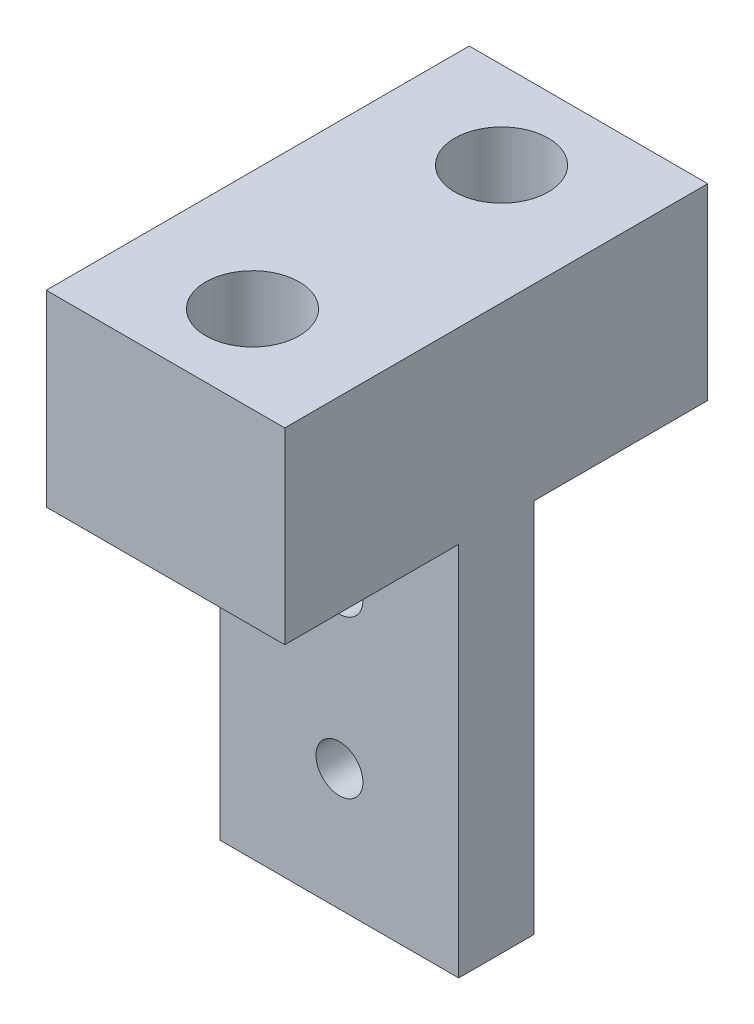
ISO-10303-21;
HEADER;
FILE_DESCRIPTION(('STEP AP214'),'2;1');
FILE_NAME('part.step','',(''),(''),'','','');
FILE_SCHEMA(('AUTOMOTIVE_DESIGN { 1 0 10303 214 1 1 1 1 }'));
ENDSEC;
DATA;
#1=APPLICATION_CONTEXT('core data for automotive mechanical design processes');
#2=APPLICATION_PROTOCOL_DEFINITION('international standard','automotive_design',2000,#1);
#3=PRODUCT_CONTEXT('',#1,'mechanical');
#4=PRODUCT('Part','Part','',(#3));
#5=PRODUCT_RELATED_PRODUCT_CATEGORY('part','',(#4));
#6=PRODUCT_DEFINITION_FORMATION('','',#4);
#7=PRODUCT_DEFINITION_CONTEXT('part definition',#1,'design');
#8=PRODUCT_DEFINITION('design','',#6,#7);
#9=PRODUCT_DEFINITION_SHAPE('','',#8);
#10=(LENGTH_UNIT() NAMED_UNIT(*) SI_UNIT(.MILLI.,.METRE.));
#11=(NAMED_UNIT(*) PLANE_ANGLE_UNIT() SI_UNIT($,.RADIAN.));
#12=(NAMED_UNIT(*) SI_UNIT($,.STERADIAN.) SOLID_ANGLE_UNIT());
#13=UNCERTAINTY_MEASURE_WITH_UNIT(LENGTH_MEASURE(1.E-05),#10,'distance_accuracy_value','');
#14=(GEOMETRIC_REPRESENTATION_CONTEXT(3) GLOBAL_UNCERTAINTY_ASSIGNED_CONTEXT((#13)) GLOBAL_UNIT_ASSIGNED_CONTEXT((#10,
#11,#12)) REPRESENTATION_CONTEXT('',''));
#15=CARTESIAN_POINT('',(0.,0.,0.));
#16=DIRECTION('',(0.,0.,1.));
#17=DIRECTION('',(1.,0.,0.));
#18=AXIS2_PLACEMENT_3D('',#15,#16,#17);
#19=CARTESIAN_POINT('',(12.7,0.,22.5248));
#20=DIRECTION('',(0.,1.,0.));
#21=DIRECTION('',(0.,0.,1.));
#22=AXIS2_PLACEMENT_3D('',#19,#20,#21);
#23=PLANE('',#22);
#24=CARTESIAN_POINT('',(6.35,0.,4.6312));
#25=DIRECTION('',(0.,-1.,0.));
#26=DIRECTION('',(0.,0.,-1.));
#27=AXIS2_PLACEMENT_3D('',#24,#25,#26);
#28=CIRCLE('',#27,2.48920000000001);
#29=CARTESIAN_POINT('',(6.35,0.,2.14199999999999));
#30=VERTEX_POINT('',#29);
#31=EDGE_CURVE('E202',#30,#30,#28,.T.);
#32=ORIENTED_EDGE('',*,*,#31,.T.);
#33=EDGE_LOOP('',(#32));
#34=FACE_BOUND('',#33,.T.);
#35=CARTESIAN_POINT('',(6.35,0.,17.8936));
#36=DIRECTION('',(0.,-1.,0.));
#37=DIRECTION('',(0.,0.,-1.));
#38=AXIS2_PLACEMENT_3D('',#35,#36,#37);
#39=CIRCLE('',#38,2.48920000000001);
#40=CARTESIAN_POINT('',(6.35,0.,15.4044));
#41=VERTEX_POINT('',#40);
#42=EDGE_CURVE('E121',#41,#41,#39,.T.);
#43=ORIENTED_EDGE('',*,*,#42,.T.);
#44=EDGE_LOOP('',(#43));
#45=FACE_BOUND('',#44,.T.);
#46=DIRECTION('',(0.,0.,-1.));
#47=VECTOR('',#46,1.);
#48=CARTESIAN_POINT('',(0.,0.,22.5248));
#49=LINE('',#48,#47);
#50=CARTESIAN_POINT('',(0.,0.,22.5248));
#51=VERTEX_POINT('',#50);
#52=CARTESIAN_POINT('',(0.,0.,0.));
#53=VERTEX_POINT('',#52);
#54=EDGE_CURVE('E141',#51,#53,#49,.T.);
#55=ORIENTED_EDGE('',*,*,#54,.F.);
#56=DIRECTION('',(-1.,0.,0.));
#57=VECTOR('',#56,1.);
#58=CARTESIAN_POINT('',(12.7,0.,22.5248));
#59=LINE('',#58,#57);
#60=CARTESIAN_POINT('',(12.7,0.,22.5248));
#61=VERTEX_POINT('',#60);
#62=EDGE_CURVE('E11',#61,#51,#59,.T.);
#63=ORIENTED_EDGE('',*,*,#62,.F.);
#64=DIRECTION('',(0.,0.,-1.));
#65=VECTOR('',#64,1.);
#66=CARTESIAN_POINT('',(12.7,0.,22.5248));
#67=LINE('',#66,#65);
#68=CARTESIAN_POINT('',(12.7,0.,0.));
#69=VERTEX_POINT('',#68);
#70=EDGE_CURVE('E145',#61,#69,#67,.T.);
#71=ORIENTED_EDGE('',*,*,#70,.T.);
#72=DIRECTION('',(-1.,0.,0.));
#73=VECTOR('',#72,1.);
#74=CARTESIAN_POINT('',(12.7,0.,0.));
#75=LINE('',#74,#73);
#76=EDGE_CURVE('E38',#69,#53,#75,.T.);
#77=ORIENTED_EDGE('',*,*,#76,.T.);
#78=EDGE_LOOP('',(#55,#63,#71,#77));
#79=FACE_BOUND('',#78,.T.);
#80=ADVANCED_FACE('F35',(#34,#45,#79),#23,.T.);
#81=CARTESIAN_POINT('',(12.7,-30.,22.5248));
#82=DIRECTION('',(0.,0.,1.));
#83=DIRECTION('',(1.,0.,0.));
#84=AXIS2_PLACEMENT_3D('',#81,#82,#83);
#85=PLANE('',#84);
#86=DIRECTION('',(1.,0.,0.));
#87=VECTOR('',#86,1.);
#88=CARTESIAN_POINT('',(0.,-10.,22.5248));
#89=LINE('',#88,#87);
#90=CARTESIAN_POINT('',(0.,-10.,22.5248));
#91=VERTEX_POINT('',#90);
#92=CARTESIAN_POINT('',(12.7,-10.,22.5248));
#93=VERTEX_POINT('',#92);
#94=EDGE_CURVE('E49',#91,#93,#89,.T.);
#95=ORIENTED_EDGE('',*,*,#94,.T.);
#96=DIRECTION('',(0.,1.,0.));
#97=VECTOR('',#96,1.);
#98=CARTESIAN_POINT('',(12.7,-30.,22.5248));
#99=LINE('',#98,#97);
#100=EDGE_CURVE('E155',#93,#61,#99,.T.);
#101=ORIENTED_EDGE('',*,*,#100,.T.);
#102=ORIENTED_EDGE('',*,*,#62,.T.);
#103=DIRECTION('',(0.,1.,0.));
#104=VECTOR('',#103,1.);
#105=CARTESIAN_POINT('',(0.,-30.,22.5248));
#106=LINE('',#105,#104);
#107=EDGE_CURVE('E149',#91,#51,#106,.T.);
#108=ORIENTED_EDGE('',*,*,#107,.F.);
#109=EDGE_LOOP('',(#95,#101,#102,#108));
#110=FACE_BOUND('',#109,.T.);
#111=ADVANCED_FACE('F166',(#110),#85,.T.);
#112=CARTESIAN_POINT('',(12.7,-30.,0.));
#113=DIRECTION('',(0.,-1.,0.));
#114=DIRECTION('',(0.,0.,-1.));
#115=AXIS2_PLACEMENT_3D('',#112,#113,#114);
#116=PLANE('',#115);
#117=DIRECTION('',(1.,0.,0.));
#118=VECTOR('',#117,1.);
#119=CARTESIAN_POINT('',(0.,-30.,13.2624));
#120=LINE('',#119,#118);
#121=CARTESIAN_POINT('',(0.,-30.,13.2624));
#122=VERTEX_POINT('',#121);
#123=CARTESIAN_POINT('',(12.7,-30.,13.2624));
#124=VERTEX_POINT('',#123);
#125=EDGE_CURVE('E125',#122,#124,#120,.T.);
#126=ORIENTED_EDGE('',*,*,#125,.F.);
#127=DIRECTION('',(0.,0.,1.));
#128=VECTOR('',#127,1.);
#129=CARTESIAN_POINT('',(0.,-30.,0.));
#130=LINE('',#129,#128);
#131=CARTESIAN_POINT('',(0.,-30.,9.2624));
#132=VERTEX_POINT('',#131);
#133=EDGE_CURVE('E116',#132,#122,#130,.T.);
#134=ORIENTED_EDGE('',*,*,#133,.F.);
#135=DIRECTION('',(1.,0.,0.));
#136=VECTOR('',#135,1.);
#137=CARTESIAN_POINT('',(0.,-30.,9.2624));
#138=LINE('',#137,#136);
#139=CARTESIAN_POINT('',(12.7,-30.,9.2624));
#140=VERTEX_POINT('',#139);
#141=EDGE_CURVE('E138',#132,#140,#138,.T.);
#142=ORIENTED_EDGE('',*,*,#141,.T.);
#143=DIRECTION('',(0.,0.,1.));
#144=VECTOR('',#143,1.);
#145=CARTESIAN_POINT('',(12.7,-30.,0.));
#146=LINE('',#145,#144);
#147=EDGE_CURVE('E152',#140,#124,#146,.T.);
#148=ORIENTED_EDGE('',*,*,#147,.T.);
#149=EDGE_LOOP('',(#126,#134,#142,#148));
#150=FACE_BOUND('',#149,.T.);
#151=ADVANCED_FACE('F183',(#150),#116,.T.);
#152=CARTESIAN_POINT('',(12.7,0.,0.));
#153=DIRECTION('',(0.,0.,-1.));
#154=DIRECTION('',(-1.,0.,0.));
#155=AXIS2_PLACEMENT_3D('',#152,#153,#154);
#156=PLANE('',#155);
#157=DIRECTION('',(1.,0.,0.));
#158=VECTOR('',#157,1.);
#159=CARTESIAN_POINT('',(0.,-10.,0.));
#160=LINE('',#159,#158);
#161=CARTESIAN_POINT('',(0.,-10.,0.));
#162=VERTEX_POINT('',#161);
#163=CARTESIAN_POINT('',(12.7,-10.,0.));
#164=VERTEX_POINT('',#163);
#165=EDGE_CURVE('E134',#162,#164,#160,.T.);
#166=ORIENTED_EDGE('',*,*,#165,.F.);
#167=DIRECTION('',(0.,-1.,0.));
#168=VECTOR('',#167,1.);
#169=CARTESIAN_POINT('',(0.,0.,0.));
#170=LINE('',#169,#168);
#171=EDGE_CURVE('E159',#53,#162,#170,.T.);
#172=ORIENTED_EDGE('',*,*,#171,.F.);
#173=ORIENTED_EDGE('',*,*,#76,.F.);
#174=DIRECTION('',(0.,-1.,0.));
#175=VECTOR('',#174,1.);
#176=CARTESIAN_POINT('',(12.7,0.,0.));
#177=LINE('',#176,#175);
#178=EDGE_CURVE('E148',#69,#164,#177,.T.);
#179=ORIENTED_EDGE('',*,*,#178,.T.);
#180=EDGE_LOOP('',(#166,#172,#173,#179));
#181=FACE_BOUND('',#180,.T.);
#182=ADVANCED_FACE('F174',(#181),#156,.T.);
#183=CARTESIAN_POINT('',(12.7,0.,0.));
#184=DIRECTION('',(-1.,0.,0.));
#185=DIRECTION('',(0.,0.,1.));
#186=AXIS2_PLACEMENT_3D('',#183,#184,#185);
#187=PLANE('',#186);
#188=DIRECTION('',(0.,0.,1.));
#189=VECTOR('',#188,1.);
#190=CARTESIAN_POINT('',(12.7,-10.,13.2624));
#191=LINE('',#190,#189);
#192=CARTESIAN_POINT('',(12.7,-10.,13.2624));
#193=VERTEX_POINT('',#192);
#194=EDGE_CURVE('E117',#193,#93,#191,.T.);
#195=ORIENTED_EDGE('',*,*,#194,.F.);
#196=DIRECTION('',(0.,1.,0.));
#197=VECTOR('',#196,1.);
#198=CARTESIAN_POINT('',(12.7,-30.,13.2624));
#199=LINE('',#198,#197);
#200=EDGE_CURVE('E105',#124,#193,#199,.T.);
#201=ORIENTED_EDGE('',*,*,#200,.F.);
#202=ORIENTED_EDGE('',*,*,#147,.F.);
#203=DIRECTION('',(0.,-1.,0.));
#204=VECTOR('',#203,1.);
#205=CARTESIAN_POINT('',(12.7,-10.,9.2624));
#206=LINE('',#205,#204);
#207=CARTESIAN_POINT('',(12.7,-10.,9.2624));
#208=VERTEX_POINT('',#207);
#209=EDGE_CURVE('E132',#208,#140,#206,.T.);
#210=ORIENTED_EDGE('',*,*,#209,.F.);
#211=DIRECTION('',(0.,0.,1.));
#212=VECTOR('',#211,1.);
#213=CARTESIAN_POINT('',(12.7,-10.,0.));
#214=LINE('',#213,#212);
#215=EDGE_CURVE('E127',#164,#208,#214,.T.);
#216=ORIENTED_EDGE('',*,*,#215,.F.);
#217=ORIENTED_EDGE('',*,*,#178,.F.);
#218=ORIENTED_EDGE('',*,*,#70,.F.);
#219=ORIENTED_EDGE('',*,*,#100,.F.);
#220=EDGE_LOOP('',(#195,#201,#202,#210,#216,#217,#218,#219));
#221=FACE_BOUND('',#220,.T.);
#222=ADVANCED_FACE('F184',(#221),#187,.F.);
#223=CARTESIAN_POINT('',(0.,0.,0.));
#224=DIRECTION('',(-1.,0.,0.));
#225=DIRECTION('',(0.,0.,1.));
#226=AXIS2_PLACEMENT_3D('',#223,#224,#225);
#227=PLANE('',#226);
#228=DIRECTION('',(0.,1.,0.));
#229=VECTOR('',#228,1.);
#230=CARTESIAN_POINT('',(0.,-30.,13.2624));
#231=LINE('',#230,#229);
#232=CARTESIAN_POINT('',(0.,-10.,13.2624));
#233=VERTEX_POINT('',#232);
#234=EDGE_CURVE('E102',#122,#233,#231,.T.);
#235=ORIENTED_EDGE('',*,*,#234,.T.);
#236=DIRECTION('',(0.,0.,1.));
#237=VECTOR('',#236,1.);
#238=CARTESIAN_POINT('',(0.,-10.,13.2624));
#239=LINE('',#238,#237);
#240=EDGE_CURVE('E107',#233,#91,#239,.T.);
#241=ORIENTED_EDGE('',*,*,#240,.T.);
#242=ORIENTED_EDGE('',*,*,#107,.T.);
#243=ORIENTED_EDGE('',*,*,#54,.T.);
#244=ORIENTED_EDGE('',*,*,#171,.T.);
#245=DIRECTION('',(0.,0.,1.));
#246=VECTOR('',#245,1.);
#247=CARTESIAN_POINT('',(0.,-10.,0.));
#248=LINE('',#247,#246);
#249=CARTESIAN_POINT('',(0.,-10.,9.2624));
#250=VERTEX_POINT('',#249);
#251=EDGE_CURVE('E129',#162,#250,#248,.T.);
#252=ORIENTED_EDGE('',*,*,#251,.T.);
#253=DIRECTION('',(0.,-1.,0.));
#254=VECTOR('',#253,1.);
#255=CARTESIAN_POINT('',(0.,-10.,9.2624));
#256=LINE('',#255,#254);
#257=EDGE_CURVE('E57',#250,#132,#256,.T.);
#258=ORIENTED_EDGE('',*,*,#257,.T.);
#259=ORIENTED_EDGE('',*,*,#133,.T.);
#260=EDGE_LOOP('',(#235,#241,#242,#243,#244,#252,#258,#259));
#261=FACE_BOUND('',#260,.T.);
#262=ADVANCED_FACE('F114',(#261),#227,.T.);
#263=CARTESIAN_POINT('',(0.,-10.,9.2624));
#264=DIRECTION('',(0.,0.,1.));
#265=DIRECTION('',(1.,0.,0.));
#266=AXIS2_PLACEMENT_3D('',#263,#264,#265);
#267=PLANE('',#266);
#268=CARTESIAN_POINT('',(6.35,-15.1436724707281,9.2624));
#269=DIRECTION('',(0.,0.,1.));
#270=DIRECTION('',(1.,0.,0.));
#271=AXIS2_PLACEMENT_3D('',#268,#269,#270);
#272=CIRCLE('',#271,1.25);
#273=CARTESIAN_POINT('',(7.6,-15.1436724707281,9.2624));
#274=VERTEX_POINT('',#273);
#275=EDGE_CURVE('E227',#274,#274,#272,.T.);
#276=ORIENTED_EDGE('',*,*,#275,.T.);
#277=EDGE_LOOP('',(#276));
#278=FACE_BOUND('',#277,.T.);
#279=CARTESIAN_POINT('',(6.35,-23.5206001253019,9.2624));
#280=DIRECTION('',(0.,0.,1.));
#281=DIRECTION('',(1.,0.,0.));
#282=AXIS2_PLACEMENT_3D('',#279,#280,#281);
#283=CIRCLE('',#282,1.25);
#284=CARTESIAN_POINT('',(7.6,-23.5206001253019,9.2624));
#285=VERTEX_POINT('',#284);
#286=EDGE_CURVE('E230',#285,#285,#283,.T.);
#287=ORIENTED_EDGE('',*,*,#286,.T.);
#288=EDGE_LOOP('',(#287));
#289=FACE_BOUND('',#288,.T.);
#290=ORIENTED_EDGE('',*,*,#209,.T.);
#291=ORIENTED_EDGE('',*,*,#141,.F.);
#292=ORIENTED_EDGE('',*,*,#257,.F.);
#293=DIRECTION('',(1.,0.,0.));
#294=VECTOR('',#293,1.);
#295=CARTESIAN_POINT('',(0.,-10.,9.2624));
#296=LINE('',#295,#294);
#297=EDGE_CURVE('E142',#250,#208,#296,.T.);
#298=ORIENTED_EDGE('',*,*,#297,.T.);
#299=EDGE_LOOP('',(#290,#291,#292,#298));
#300=FACE_BOUND('',#299,.T.);
#301=ADVANCED_FACE('F179',(#278,#289,#300),#267,.F.);
#302=CARTESIAN_POINT('',(0.,-10.,0.));
#303=DIRECTION('',(0.,1.,0.));
#304=DIRECTION('',(0.,0.,1.));
#305=AXIS2_PLACEMENT_3D('',#302,#303,#304);
#306=PLANE('',#305);
#307=CARTESIAN_POINT('',(6.35,-10.,4.6312));
#308=DIRECTION('',(0.,-1.,0.));
#309=DIRECTION('',(0.,0.,-1.));
#310=AXIS2_PLACEMENT_3D('',#307,#308,#309);
#311=CIRCLE('',#310,3.96875000000001);
#312=CARTESIAN_POINT('',(6.35,-10.,0.662449999999986));
#313=VERTEX_POINT('',#312);
#314=EDGE_CURVE('E224',#313,#313,#311,.T.);
#315=ORIENTED_EDGE('',*,*,#314,.F.);
#316=EDGE_LOOP('',(#315));
#317=FACE_BOUND('',#316,.T.);
#318=ORIENTED_EDGE('',*,*,#215,.T.);
#319=ORIENTED_EDGE('',*,*,#297,.F.);
#320=ORIENTED_EDGE('',*,*,#251,.F.);
#321=ORIENTED_EDGE('',*,*,#165,.T.);
#322=EDGE_LOOP('',(#318,#319,#320,#321));
#323=FACE_BOUND('',#322,.T.);
#324=ADVANCED_FACE('F176',(#317,#323),#306,.F.);
#325=CARTESIAN_POINT('',(0.,-30.,13.2624));
#326=DIRECTION('',(0.,0.,-1.));
#327=DIRECTION('',(-1.,0.,0.));
#328=AXIS2_PLACEMENT_3D('',#325,#326,#327);
#329=PLANE('',#328);
#330=CARTESIAN_POINT('',(6.35,-15.1436724707281,13.2624));
#331=DIRECTION('',(0.,0.,1.));
#332=DIRECTION('',(1.,0.,0.));
#333=AXIS2_PLACEMENT_3D('',#330,#331,#332);
#334=CIRCLE('',#333,1.25);
#335=CARTESIAN_POINT('',(7.6,-15.1436724707281,13.2624));
#336=VERTEX_POINT('',#335);
#337=EDGE_CURVE('E233',#336,#336,#334,.T.);
#338=ORIENTED_EDGE('',*,*,#337,.F.);
#339=EDGE_LOOP('',(#338));
#340=FACE_BOUND('',#339,.T.);
#341=CARTESIAN_POINT('',(6.35,-23.5206001253019,13.2624));
#342=DIRECTION('',(0.,0.,1.));
#343=DIRECTION('',(1.,0.,0.));
#344=AXIS2_PLACEMENT_3D('',#341,#342,#343);
#345=CIRCLE('',#344,1.25);
#346=CARTESIAN_POINT('',(7.6,-23.5206001253019,13.2624));
#347=VERTEX_POINT('',#346);
#348=EDGE_CURVE('E234',#347,#347,#345,.T.);
#349=ORIENTED_EDGE('',*,*,#348,.F.);
#350=EDGE_LOOP('',(#349));
#351=FACE_BOUND('',#350,.T.);
#352=ORIENTED_EDGE('',*,*,#200,.T.);
#353=DIRECTION('',(1.,0.,0.));
#354=VECTOR('',#353,1.);
#355=CARTESIAN_POINT('',(0.,-10.,13.2624));
#356=LINE('',#355,#354);
#357=EDGE_CURVE('E99',#233,#193,#356,.T.);
#358=ORIENTED_EDGE('',*,*,#357,.F.);
#359=ORIENTED_EDGE('',*,*,#234,.F.);
#360=ORIENTED_EDGE('',*,*,#125,.T.);
#361=EDGE_LOOP('',(#352,#358,#359,#360));
#362=FACE_BOUND('',#361,.T.);
#363=ADVANCED_FACE('F100',(#340,#351,#362),#329,.F.);
#364=CARTESIAN_POINT('',(0.,-10.,13.2624));
#365=DIRECTION('',(0.,1.,0.));
#366=DIRECTION('',(0.,0.,1.));
#367=AXIS2_PLACEMENT_3D('',#364,#365,#366);
#368=PLANE('',#367);
#369=CARTESIAN_POINT('',(6.35,-10.,17.8936));
#370=DIRECTION('',(0.,-1.,0.));
#371=DIRECTION('',(0.,0.,-1.));
#372=AXIS2_PLACEMENT_3D('',#369,#370,#371);
#373=CIRCLE('',#372,3.96875000000001);
#374=CARTESIAN_POINT('',(6.35,-10.,13.92485));
#375=VERTEX_POINT('',#374);
#376=EDGE_CURVE('E212',#375,#375,#373,.T.);
#377=ORIENTED_EDGE('',*,*,#376,.F.);
#378=EDGE_LOOP('',(#377));
#379=FACE_BOUND('',#378,.T.);
#380=ORIENTED_EDGE('',*,*,#194,.T.);
#381=ORIENTED_EDGE('',*,*,#94,.F.);
#382=ORIENTED_EDGE('',*,*,#240,.F.);
#383=ORIENTED_EDGE('',*,*,#357,.T.);
#384=EDGE_LOOP('',(#380,#381,#382,#383));
#385=FACE_BOUND('',#384,.T.);
#386=ADVANCED_FACE('F109',(#379,#385),#368,.F.);
#387=CARTESIAN_POINT('',(6.35,-10.,17.8936));
#388=DIRECTION('',(0.,-1.,0.));
#389=DIRECTION('',(0.,0.,-1.));
#390=AXIS2_PLACEMENT_3D('',#387,#388,#389);
#391=CYLINDRICAL_SURFACE('',#390,2.48920000000001);
#392=ORIENTED_EDGE('',*,*,#42,.F.);
#393=EDGE_LOOP('',(#392));
#394=FACE_BOUND('',#393,.T.);
#395=CARTESIAN_POINT('',(6.35,-5.8344,17.8936));
#396=DIRECTION('',(0.,-1.,0.));
#397=DIRECTION('',(0.,0.,-1.));
#398=AXIS2_PLACEMENT_3D('',#395,#396,#397);
#399=CIRCLE('',#398,2.48920000000001);
#400=CARTESIAN_POINT('',(6.35,-5.8344,15.4044));
#401=VERTEX_POINT('',#400);
#402=EDGE_CURVE('E206',#401,#401,#399,.T.);
#403=ORIENTED_EDGE('',*,*,#402,.T.);
#404=EDGE_LOOP('',(#403));
#405=FACE_BOUND('',#404,.T.);
#406=ADVANCED_FACE('F266',(#394,#405),#391,.F.);
#407=CARTESIAN_POINT('',(8.83920000000001,-5.8344,17.8936));
#408=DIRECTION('',(0.,1.,0.));
#409=DIRECTION('',(0.,0.,1.));
#410=AXIS2_PLACEMENT_3D('',#407,#408,#409);
#411=PLANE('',#410);
#412=ORIENTED_EDGE('',*,*,#402,.F.);
#413=EDGE_LOOP('',(#412));
#414=FACE_BOUND('',#413,.T.);
#415=CARTESIAN_POINT('',(6.35,-5.8344,17.8936));
#416=DIRECTION('',(0.,-1.,0.));
#417=DIRECTION('',(0.,0.,-1.));
#418=AXIS2_PLACEMENT_3D('',#415,#416,#417);
#419=CIRCLE('',#418,3.96875000000001);
#420=CARTESIAN_POINT('',(6.35,-5.8344,13.92485));
#421=VERTEX_POINT('',#420);
#422=EDGE_CURVE('E208',#421,#421,#419,.T.);
#423=ORIENTED_EDGE('',*,*,#422,.T.);
#424=EDGE_LOOP('',(#423));
#425=FACE_BOUND('',#424,.T.);
#426=ADVANCED_FACE('F270',(#414,#425),#411,.F.);
#427=CARTESIAN_POINT('',(6.35,-10.,17.8936));
#428=DIRECTION('',(0.,-1.,0.));
#429=DIRECTION('',(0.,0.,-1.));
#430=AXIS2_PLACEMENT_3D('',#427,#428,#429);
#431=CYLINDRICAL_SURFACE('',#430,3.96875000000001);
#432=ORIENTED_EDGE('',*,*,#422,.F.);
#433=EDGE_LOOP('',(#432));
#434=FACE_BOUND('',#433,.T.);
#435=ORIENTED_EDGE('',*,*,#376,.T.);
#436=EDGE_LOOP('',(#435));
#437=FACE_BOUND('',#436,.T.);
#438=ADVANCED_FACE('F273',(#434,#437),#431,.F.);
#439=CARTESIAN_POINT('',(6.35,-10.,4.6312));
#440=DIRECTION('',(0.,-1.,0.));
#441=DIRECTION('',(0.,0.,-1.));
#442=AXIS2_PLACEMENT_3D('',#439,#440,#441);
#443=CYLINDRICAL_SURFACE('',#442,2.48920000000001);
#444=ORIENTED_EDGE('',*,*,#31,.F.);
#445=EDGE_LOOP('',(#444));
#446=FACE_BOUND('',#445,.T.);
#447=CARTESIAN_POINT('',(6.35,-5.8344,4.6312));
#448=DIRECTION('',(0.,-1.,0.));
#449=DIRECTION('',(0.,0.,-1.));
#450=AXIS2_PLACEMENT_3D('',#447,#448,#449);
#451=CIRCLE('',#450,2.48920000000001);
#452=CARTESIAN_POINT('',(6.35,-5.8344,2.14199999999999));
#453=VERTEX_POINT('',#452);
#454=EDGE_CURVE('E218',#453,#453,#451,.T.);
#455=ORIENTED_EDGE('',*,*,#454,.T.);
#456=EDGE_LOOP('',(#455));
#457=FACE_BOUND('',#456,.T.);
#458=ADVANCED_FACE('F277',(#446,#457),#443,.F.);
#459=CARTESIAN_POINT('',(8.83920000000001,-5.8344,4.6312));
#460=DIRECTION('',(0.,1.,0.));
#461=DIRECTION('',(0.,0.,1.));
#462=AXIS2_PLACEMENT_3D('',#459,#460,#461);
#463=PLANE('',#462);
#464=ORIENTED_EDGE('',*,*,#454,.F.);
#465=EDGE_LOOP('',(#464));
#466=FACE_BOUND('',#465,.T.);
#467=CARTESIAN_POINT('',(6.35,-5.8344,4.6312));
#468=DIRECTION('',(0.,-1.,0.));
#469=DIRECTION('',(0.,0.,-1.));
#470=AXIS2_PLACEMENT_3D('',#467,#468,#469);
#471=CIRCLE('',#470,3.96875000000001);
#472=CARTESIAN_POINT('',(6.35,-5.8344,0.66244999999999));
#473=VERTEX_POINT('',#472);
#474=EDGE_CURVE('E221',#473,#473,#471,.T.);
#475=ORIENTED_EDGE('',*,*,#474,.T.);
#476=EDGE_LOOP('',(#475));
#477=FACE_BOUND('',#476,.T.);
#478=ADVANCED_FACE('F281',(#466,#477),#463,.F.);
#479=CARTESIAN_POINT('',(6.35,-10.,4.6312));
#480=DIRECTION('',(0.,-1.,0.));
#481=DIRECTION('',(0.,0.,-1.));
#482=AXIS2_PLACEMENT_3D('',#479,#480,#481);
#483=CYLINDRICAL_SURFACE('',#482,3.96875000000001);
#484=ORIENTED_EDGE('',*,*,#474,.F.);
#485=EDGE_LOOP('',(#484));
#486=FACE_BOUND('',#485,.T.);
#487=ORIENTED_EDGE('',*,*,#314,.T.);
#488=EDGE_LOOP('',(#487));
#489=FACE_BOUND('',#488,.T.);
#490=ADVANCED_FACE('F251',(#486,#489),#483,.F.);
#491=CARTESIAN_POINT('',(6.35,-23.5206001253019,3.2624));
#492=DIRECTION('',(0.,0.,1.));
#493=DIRECTION('',(1.,0.,0.));
#494=AXIS2_PLACEMENT_3D('',#491,#492,#493);
#495=CYLINDRICAL_SURFACE('',#494,1.25);
#496=ORIENTED_EDGE('',*,*,#348,.T.);
#497=EDGE_LOOP('',(#496));
#498=FACE_BOUND('',#497,.T.);
#499=ORIENTED_EDGE('',*,*,#286,.F.);
#500=EDGE_LOOP('',(#499));
#501=FACE_BOUND('',#500,.T.);
#502=ADVANCED_FACE('F248',(#498,#501),#495,.F.);
#503=CARTESIAN_POINT('',(6.35,-15.1436724707281,3.2624));
#504=DIRECTION('',(0.,0.,1.));
#505=DIRECTION('',(1.,0.,0.));
#506=AXIS2_PLACEMENT_3D('',#503,#504,#505);
#507=CYLINDRICAL_SURFACE('',#506,1.25);
#508=ORIENTED_EDGE('',*,*,#337,.T.);
#509=EDGE_LOOP('',(#508));
#510=FACE_BOUND('',#509,.T.);
#511=ORIENTED_EDGE('',*,*,#275,.F.);
#512=EDGE_LOOP('',(#511));
#513=FACE_BOUND('',#512,.T.);
#514=ADVANCED_FACE('F240',(#510,#513),#507,.F.);
#515=CLOSED_SHELL('',(#80,#111,#151,#182,#222,#262,#301,#324,#363,#386,#406,#426,#438,#458,#478,
#490,#502,#514));
#516=MANIFOLD_SOLID_BREP('B2',#515);
#517=ADVANCED_BREP_SHAPE_REPRESENTATION('',(#18,#516),#14);
#518=SHAPE_DEFINITION_REPRESENTATION(#9,#517);
ENDSEC;
END-ISO-10303-21;
